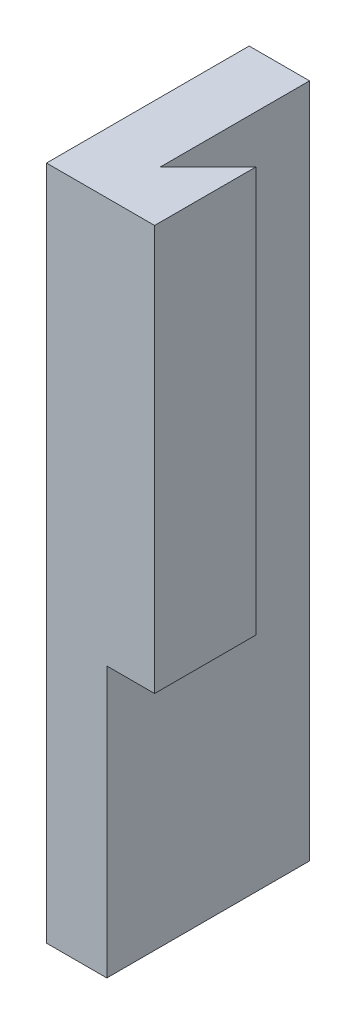
ISO-10303-21;
HEADER;
FILE_DESCRIPTION(('STEP AP214'),'2;1');
FILE_NAME('part.step','',(''),(''),'','','');
FILE_SCHEMA(('AUTOMOTIVE_DESIGN { 1 0 10303 214 1 1 1 1 }'));
ENDSEC;
DATA;
#1=APPLICATION_CONTEXT('core data for automotive mechanical design processes');
#2=APPLICATION_PROTOCOL_DEFINITION('international standard','automotive_design',2000,#1);
#3=PRODUCT_CONTEXT('',#1,'mechanical');
#4=PRODUCT('Part','Part','',(#3));
#5=PRODUCT_RELATED_PRODUCT_CATEGORY('part','',(#4));
#6=PRODUCT_DEFINITION_FORMATION('','',#4);
#7=PRODUCT_DEFINITION_CONTEXT('part definition',#1,'design');
#8=PRODUCT_DEFINITION('design','',#6,#7);
#9=PRODUCT_DEFINITION_SHAPE('','',#8);
#10=(LENGTH_UNIT() NAMED_UNIT(*) SI_UNIT(.MILLI.,.METRE.));
#11=(NAMED_UNIT(*) PLANE_ANGLE_UNIT() SI_UNIT($,.RADIAN.));
#12=(NAMED_UNIT(*) SI_UNIT($,.STERADIAN.) SOLID_ANGLE_UNIT());
#13=UNCERTAINTY_MEASURE_WITH_UNIT(LENGTH_MEASURE(1.E-05),#10,'distance_accuracy_value','');
#14=(GEOMETRIC_REPRESENTATION_CONTEXT(3) GLOBAL_UNCERTAINTY_ASSIGNED_CONTEXT((#13)) GLOBAL_UNIT_ASSIGNED_CONTEXT((#10,
#11,#12)) REPRESENTATION_CONTEXT('',''));
#15=CARTESIAN_POINT('',(0.,0.,0.));
#16=DIRECTION('',(0.,0.,1.));
#17=DIRECTION('',(1.,0.,0.));
#18=AXIS2_PLACEMENT_3D('',#15,#16,#17);
#19=CARTESIAN_POINT('',(51.5355339059328,-0.0100000000000031,15.));
#20=DIRECTION('',(-1.,0.,0.));
#21=DIRECTION('',(0.,0.,1.));
#22=AXIS2_PLACEMENT_3D('',#19,#20,#21);
#23=PLANE('',#22);
#24=DIRECTION('',(0.,-1.,0.));
#25=VECTOR('',#24,1.);
#26=CARTESIAN_POINT('',(51.5355339059328,0.,0.));
#27=LINE('',#26,#25);
#28=CARTESIAN_POINT('',(51.5355339059328,28.835389797957,0.));
#29=VERTEX_POINT('',#28);
#30=CARTESIAN_POINT('',(51.5355339059328,0.,0.));
#31=VERTEX_POINT('',#30);
#32=EDGE_CURVE('E121',#29,#31,#27,.T.);
#33=ORIENTED_EDGE('',*,*,#32,.T.);
#34=DIRECTION('',(0.,0.,1.));
#35=VECTOR('',#34,1.);
#36=CARTESIAN_POINT('',(51.5355339059328,0.,30.));
#37=LINE('',#36,#35);
#38=CARTESIAN_POINT('',(51.5355339059328,0.,15.));
#39=VERTEX_POINT('',#38);
#40=EDGE_CURVE('E176',#31,#39,#37,.T.);
#41=ORIENTED_EDGE('',*,*,#40,.T.);
#42=DIRECTION('',(0.,1.,0.));
#43=VECTOR('',#42,1.);
#44=CARTESIAN_POINT('',(51.5355339059328,-0.0100000000000031,15.));
#45=LINE('',#44,#43);
#46=CARTESIAN_POINT('',(51.5355339059328,50.,15.));
#47=VERTEX_POINT('',#46);
#48=EDGE_CURVE('E11',#39,#47,#45,.T.);
#49=ORIENTED_EDGE('',*,*,#48,.T.);
#50=DIRECTION('',(0.,0.,1.));
#51=VECTOR('',#50,1.);
#52=CARTESIAN_POINT('',(51.5355339059328,50.,30.));
#53=LINE('',#52,#51);
#54=CARTESIAN_POINT('',(51.5355339059328,50.,0.));
#55=VERTEX_POINT('',#54);
#56=EDGE_CURVE('E133',#55,#47,#53,.T.);
#57=ORIENTED_EDGE('',*,*,#56,.F.);
#58=CARTESIAN_POINT('',(51.5355339059328,32.164610202043,0.));
#59=VERTEX_POINT('',#58);
#60=EDGE_CURVE('E119',#55,#59,#27,.T.);
#61=ORIENTED_EDGE('',*,*,#60,.T.);
#62=DIRECTION('',(0.,0.,-1.));
#63=VECTOR('',#62,1.);
#64=CARTESIAN_POINT('',(51.5355339059328,32.164610202043,6.));
#65=LINE('',#64,#63);
#66=CARTESIAN_POINT('',(51.5355339059328,32.164610202043,6.));
#67=VERTEX_POINT('',#66);
#68=EDGE_CURVE('E130',#59,#67,#65,.F.);
#69=ORIENTED_EDGE('',*,*,#68,.T.);
#70=DIRECTION('',(0.,1.,0.));
#71=VECTOR('',#70,1.);
#72=CARTESIAN_POINT('',(51.5355339059328,30.5,6.));
#73=LINE('',#72,#71);
#74=CARTESIAN_POINT('',(51.5355339059328,28.835389797957,6.));
#75=VERTEX_POINT('',#74);
#76=EDGE_CURVE('E146',#75,#67,#73,.T.);
#77=ORIENTED_EDGE('',*,*,#76,.F.);
#78=DIRECTION('',(0.,0.,-1.));
#79=VECTOR('',#78,1.);
#80=CARTESIAN_POINT('',(51.5355339059328,28.835389797957,6.));
#81=LINE('',#80,#79);
#82=EDGE_CURVE('E138',#75,#29,#81,.T.);
#83=ORIENTED_EDGE('',*,*,#82,.T.);
#84=EDGE_LOOP('',(#33,#41,#49,#57,#61,#69,#77,#83));
#85=FACE_BOUND('',#84,.T.);
#86=ADVANCED_FACE('F37',(#85),#23,.T.);
#87=CARTESIAN_POINT('',(71.5355339059328,-0.0100000000000031,15.));
#88=DIRECTION('',(0.,0.,1.));
#89=DIRECTION('',(1.,0.,0.));
#90=AXIS2_PLACEMENT_3D('',#87,#88,#89);
#91=PLANE('',#90);
#92=ORIENTED_EDGE('',*,*,#48,.F.);
#93=DIRECTION('',(1.,0.,0.));
#94=VECTOR('',#93,1.);
#95=CARTESIAN_POINT('',(0.,0.,15.));
#96=LINE('',#95,#94);
#97=CARTESIAN_POINT('',(56.,0.,15.));
#98=VERTEX_POINT('',#97);
#99=EDGE_CURVE('E179',#39,#98,#96,.T.);
#100=ORIENTED_EDGE('',*,*,#99,.T.);
#101=DIRECTION('',(0.,1.,0.));
#102=VECTOR('',#101,1.);
#103=CARTESIAN_POINT('',(56.,0.,15.));
#104=LINE('',#103,#102);
#105=CARTESIAN_POINT('',(56.,20.,15.));
#106=VERTEX_POINT('',#105);
#107=EDGE_CURVE('E134',#98,#106,#104,.T.);
#108=ORIENTED_EDGE('',*,*,#107,.T.);
#109=DIRECTION('',(-1.,0.,0.));
#110=VECTOR('',#109,1.);
#111=CARTESIAN_POINT('',(0.,20.,15.));
#112=LINE('',#111,#110);
#113=CARTESIAN_POINT('',(59.5355339059328,20.,15.));
#114=VERTEX_POINT('',#113);
#115=EDGE_CURVE('E171',#114,#106,#112,.T.);
#116=ORIENTED_EDGE('',*,*,#115,.F.);
#117=DIRECTION('',(0.,-1.,0.));
#118=VECTOR('',#117,1.);
#119=CARTESIAN_POINT('',(59.5355339059328,20.,15.));
#120=LINE('',#119,#118);
#121=CARTESIAN_POINT('',(59.5355339059328,50.,15.));
#122=VERTEX_POINT('',#121);
#123=EDGE_CURVE('E169',#122,#114,#120,.T.);
#124=ORIENTED_EDGE('',*,*,#123,.F.);
#125=DIRECTION('',(1.,0.,0.));
#126=VECTOR('',#125,1.);
#127=CARTESIAN_POINT('',(0.,50.,15.));
#128=LINE('',#127,#126);
#129=EDGE_CURVE('E173',#47,#122,#128,.T.);
#130=ORIENTED_EDGE('',*,*,#129,.F.);
#131=EDGE_LOOP('',(#92,#100,#108,#116,#124,#130));
#132=FACE_BOUND('',#131,.T.);
#133=ADVANCED_FACE('F184',(#132),#91,.T.);
#134=CARTESIAN_POINT('',(0.,0.,30.));
#135=DIRECTION('',(0.,1.,0.));
#136=DIRECTION('',(0.,0.,1.));
#137=AXIS2_PLACEMENT_3D('',#134,#135,#136);
#138=PLANE('',#137);
#139=ORIENTED_EDGE('',*,*,#40,.F.);
#140=DIRECTION('',(1.,0.,0.));
#141=VECTOR('',#140,1.);
#142=CARTESIAN_POINT('',(0.,0.,0.));
#143=LINE('',#142,#141);
#144=CARTESIAN_POINT('',(56.,0.,0.));
#145=VERTEX_POINT('',#144);
#146=EDGE_CURVE('E152',#31,#145,#143,.T.);
#147=ORIENTED_EDGE('',*,*,#146,.T.);
#148=DIRECTION('',(0.,0.,-1.));
#149=VECTOR('',#148,1.);
#150=CARTESIAN_POINT('',(56.,0.,30.));
#151=LINE('',#150,#149);
#152=EDGE_CURVE('E73',#98,#145,#151,.T.);
#153=ORIENTED_EDGE('',*,*,#152,.F.);
#154=ORIENTED_EDGE('',*,*,#99,.F.);
#155=EDGE_LOOP('',(#139,#147,#153,#154));
#156=FACE_BOUND('',#155,.T.);
#157=ADVANCED_FACE('F197',(#156),#138,.F.);
#158=CARTESIAN_POINT('',(56.,0.,30.));
#159=DIRECTION('',(-1.,0.,0.));
#160=DIRECTION('',(0.,-1.,0.));
#161=AXIS2_PLACEMENT_3D('',#158,#159,#160);
#162=PLANE('',#161);
#163=ORIENTED_EDGE('',*,*,#107,.F.);
#164=ORIENTED_EDGE('',*,*,#152,.T.);
#165=DIRECTION('',(0.,1.,0.));
#166=VECTOR('',#165,1.);
#167=CARTESIAN_POINT('',(56.,0.,0.));
#168=LINE('',#167,#166);
#169=CARTESIAN_POINT('',(56.,50.,0.));
#170=VERTEX_POINT('',#169);
#171=EDGE_CURVE('E151',#145,#170,#168,.T.);
#172=ORIENTED_EDGE('',*,*,#171,.T.);
#173=DIRECTION('',(0.,0.,-1.));
#174=VECTOR('',#173,1.);
#175=CARTESIAN_POINT('',(56.,50.,30.));
#176=LINE('',#175,#174);
#177=CARTESIAN_POINT('',(56.,50.,11.0355339059327));
#178=VERTEX_POINT('',#177);
#179=EDGE_CURVE('E148',#178,#170,#176,.T.);
#180=ORIENTED_EDGE('',*,*,#179,.F.);
#181=DIRECTION('',(0.,1.,0.));
#182=VECTOR('',#181,1.);
#183=CARTESIAN_POINT('',(56.0000000000001,20.,11.0355339059327));
#184=LINE('',#183,#182);
#185=CARTESIAN_POINT('',(56.0000000000001,20.,11.0355339059327));
#186=VERTEX_POINT('',#185);
#187=EDGE_CURVE('E157',#186,#178,#184,.T.);
#188=ORIENTED_EDGE('',*,*,#187,.F.);
#189=DIRECTION('',(0.,0.,1.));
#190=VECTOR('',#189,1.);
#191=CARTESIAN_POINT('',(56.,20.,30.));
#192=LINE('',#191,#190);
#193=EDGE_CURVE('E143',#186,#106,#192,.T.);
#194=ORIENTED_EDGE('',*,*,#193,.T.);
#195=EDGE_LOOP('',(#163,#164,#172,#180,#188,#194));
#196=FACE_BOUND('',#195,.T.);
#197=ADVANCED_FACE('F187',(#196),#162,.F.);
#198=CARTESIAN_POINT('',(59.5355339059328,20.,7.5));
#199=DIRECTION('',(-0.707106781186547,0.,-0.707106781186548));
#200=DIRECTION('',(-0.707106781186548,0.,0.707106781186547));
#201=AXIS2_PLACEMENT_3D('',#198,#199,#200);
#202=PLANE('',#201);
#203=DIRECTION('',(-0.707106781186548,0.,0.707106781186547));
#204=VECTOR('',#203,1.);
#205=CARTESIAN_POINT('',(59.5355339059328,50.,7.5));
#206=LINE('',#205,#204);
#207=CARTESIAN_POINT('',(59.5355339059328,50.,7.5));
#208=VERTEX_POINT('',#207);
#209=EDGE_CURVE('E158',#208,#178,#206,.T.);
#210=ORIENTED_EDGE('',*,*,#209,.F.);
#211=DIRECTION('',(0.,1.,0.));
#212=VECTOR('',#211,1.);
#213=CARTESIAN_POINT('',(59.5355339059328,20.,7.5));
#214=LINE('',#213,#212);
#215=CARTESIAN_POINT('',(59.5355339059328,20.,7.5));
#216=VERTEX_POINT('',#215);
#217=EDGE_CURVE('E154',#216,#208,#214,.T.);
#218=ORIENTED_EDGE('',*,*,#217,.F.);
#219=DIRECTION('',(-0.707106781186548,0.,0.707106781186547));
#220=VECTOR('',#219,1.);
#221=CARTESIAN_POINT('',(59.5355339059328,20.,7.5));
#222=LINE('',#221,#220);
#223=EDGE_CURVE('E156',#216,#186,#222,.T.);
#224=ORIENTED_EDGE('',*,*,#223,.T.);
#225=ORIENTED_EDGE('',*,*,#187,.T.);
#226=EDGE_LOOP('',(#210,#218,#224,#225));
#227=FACE_BOUND('',#226,.T.);
#228=ADVANCED_FACE('F193',(#227),#202,.T.);
#229=CARTESIAN_POINT('',(0.,20.,0.));
#230=DIRECTION('',(0.,-1.,0.));
#231=DIRECTION('',(0.,0.,-1.));
#232=AXIS2_PLACEMENT_3D('',#229,#230,#231);
#233=PLANE('',#232);
#234=DIRECTION('',(0.,0.,-1.));
#235=VECTOR('',#234,1.);
#236=CARTESIAN_POINT('',(59.5355339059328,20.,7.5));
#237=LINE('',#236,#235);
#238=EDGE_CURVE('E65',#114,#216,#237,.T.);
#239=ORIENTED_EDGE('',*,*,#238,.F.);
#240=ORIENTED_EDGE('',*,*,#115,.T.);
#241=ORIENTED_EDGE('',*,*,#193,.F.);
#242=ORIENTED_EDGE('',*,*,#223,.F.);
#243=EDGE_LOOP('',(#239,#240,#241,#242));
#244=FACE_BOUND('',#243,.T.);
#245=ADVANCED_FACE('F191',(#244),#233,.T.);
#246=CARTESIAN_POINT('',(0.,50.,30.));
#247=DIRECTION('',(0.,1.,0.));
#248=DIRECTION('',(0.,0.,1.));
#249=AXIS2_PLACEMENT_3D('',#246,#247,#248);
#250=PLANE('',#249);
#251=DIRECTION('',(1.,0.,0.));
#252=VECTOR('',#251,1.);
#253=CARTESIAN_POINT('',(0.,50.,0.));
#254=LINE('',#253,#252);
#255=EDGE_CURVE('E81',#55,#170,#254,.T.);
#256=ORIENTED_EDGE('',*,*,#255,.F.);
#257=ORIENTED_EDGE('',*,*,#56,.T.);
#258=ORIENTED_EDGE('',*,*,#129,.T.);
#259=DIRECTION('',(0.,0.,-1.));
#260=VECTOR('',#259,1.);
#261=CARTESIAN_POINT('',(59.5355339059328,50.,7.5));
#262=LINE('',#261,#260);
#263=EDGE_CURVE('E54',#122,#208,#262,.T.);
#264=ORIENTED_EDGE('',*,*,#263,.T.);
#265=ORIENTED_EDGE('',*,*,#209,.T.);
#266=ORIENTED_EDGE('',*,*,#179,.T.);
#267=EDGE_LOOP('',(#256,#257,#258,#264,#265,#266));
#268=FACE_BOUND('',#267,.T.);
#269=ADVANCED_FACE('F213',(#268),#250,.T.);
#270=CARTESIAN_POINT('',(59.5355339059328,20.,7.5));
#271=DIRECTION('',(1.,0.,0.));
#272=DIRECTION('',(0.,0.,-1.));
#273=AXIS2_PLACEMENT_3D('',#270,#271,#272);
#274=PLANE('',#273);
#275=ORIENTED_EDGE('',*,*,#263,.F.);
#276=ORIENTED_EDGE('',*,*,#123,.T.);
#277=ORIENTED_EDGE('',*,*,#238,.T.);
#278=ORIENTED_EDGE('',*,*,#217,.T.);
#279=EDGE_LOOP('',(#275,#276,#277,#278));
#280=FACE_BOUND('',#279,.T.);
#281=ADVANCED_FACE('F216',(#280),#274,.T.);
#282=CARTESIAN_POINT('',(0.,0.,0.));
#283=DIRECTION('',(0.,0.,1.));
#284=DIRECTION('',(1.,0.,0.));
#285=AXIS2_PLACEMENT_3D('',#282,#283,#284);
#286=PLANE('',#285);
#287=ORIENTED_EDGE('',*,*,#60,.F.);
#288=ORIENTED_EDGE('',*,*,#255,.T.);
#289=ORIENTED_EDGE('',*,*,#171,.F.);
#290=ORIENTED_EDGE('',*,*,#146,.F.);
#291=ORIENTED_EDGE('',*,*,#32,.F.);
#292=CARTESIAN_POINT('',(48.4,30.5,0.));
#293=DIRECTION('',(0.,0.,-1.));
#294=DIRECTION('',(-1.,0.,0.));
#295=AXIS2_PLACEMENT_3D('',#292,#293,#294);
#296=CIRCLE('',#295,3.55);
#297=EDGE_CURVE('E41',#59,#29,#296,.T.);
#298=ORIENTED_EDGE('',*,*,#297,.F.);
#299=EDGE_LOOP('',(#287,#288,#289,#290,#291,#298));
#300=FACE_BOUND('',#299,.T.);
#301=ADVANCED_FACE('F118',(#300),#286,.F.);
#302=CARTESIAN_POINT('',(48.4,30.5,6.));
#303=DIRECTION('',(0.,0.,-1.));
#304=DIRECTION('',(-1.,0.,0.));
#305=AXIS2_PLACEMENT_3D('',#302,#303,#304);
#306=CYLINDRICAL_SURFACE('',#305,3.55);
#307=ORIENTED_EDGE('',*,*,#68,.F.);
#308=ORIENTED_EDGE('',*,*,#297,.T.);
#309=ORIENTED_EDGE('',*,*,#82,.F.);
#310=CARTESIAN_POINT('',(48.4,30.5,6.));
#311=DIRECTION('',(0.,0.,-1.));
#312=DIRECTION('',(-1.,0.,0.));
#313=AXIS2_PLACEMENT_3D('',#310,#311,#312);
#314=CIRCLE('',#313,3.55);
#315=EDGE_CURVE('E126',#67,#75,#314,.T.);
#316=ORIENTED_EDGE('',*,*,#315,.F.);
#317=EDGE_LOOP('',(#307,#308,#309,#316));
#318=FACE_BOUND('',#317,.T.);
#319=ADVANCED_FACE('F136',(#318),#306,.F.);
#320=CARTESIAN_POINT('',(48.4,30.5,6.));
#321=DIRECTION('',(0.,0.,-1.));
#322=DIRECTION('',(-1.,0.,0.));
#323=AXIS2_PLACEMENT_3D('',#320,#321,#322);
#324=PLANE('',#323);
#325=ORIENTED_EDGE('',*,*,#315,.T.);
#326=ORIENTED_EDGE('',*,*,#76,.T.);
#327=EDGE_LOOP('',(#325,#326));
#328=FACE_BOUND('',#327,.T.);
#329=ADVANCED_FACE('F39',(#328),#324,.T.);
#330=CLOSED_SHELL('',(#86,#133,#157,#197,#228,#245,#269,#281,#301,#319,#329));
#331=MANIFOLD_SOLID_BREP('B2',#330);
#332=ADVANCED_BREP_SHAPE_REPRESENTATION('',(#18,#331),#14);
#333=SHAPE_DEFINITION_REPRESENTATION(#9,#332);
ENDSEC;
END-ISO-10303-21;
